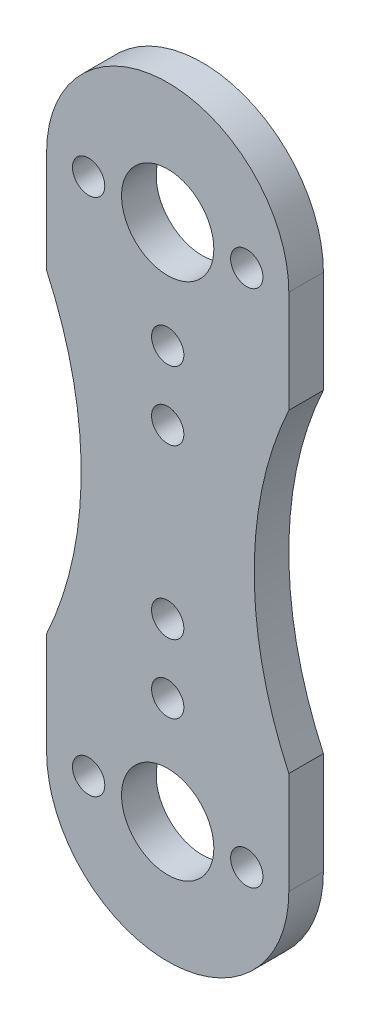
ISO-10303-21;
HEADER;
FILE_DESCRIPTION(('STEP AP214'),'2;1');
FILE_NAME('part.step','',(''),(''),'','','');
FILE_SCHEMA(('AUTOMOTIVE_DESIGN { 1 0 10303 214 1 1 1 1 }'));
ENDSEC;
DATA;
#1=APPLICATION_CONTEXT('core data for automotive mechanical design processes');
#2=APPLICATION_PROTOCOL_DEFINITION('international standard','automotive_design',2000,#1);
#3=PRODUCT_CONTEXT('',#1,'mechanical');
#4=PRODUCT('Part','Part','',(#3));
#5=PRODUCT_RELATED_PRODUCT_CATEGORY('part','',(#4));
#6=PRODUCT_DEFINITION_FORMATION('','',#4);
#7=PRODUCT_DEFINITION_CONTEXT('part definition',#1,'design');
#8=PRODUCT_DEFINITION('design','',#6,#7);
#9=PRODUCT_DEFINITION_SHAPE('','',#8);
#10=(LENGTH_UNIT() NAMED_UNIT(*) SI_UNIT(.MILLI.,.METRE.));
#11=(NAMED_UNIT(*) PLANE_ANGLE_UNIT() SI_UNIT($,.RADIAN.));
#12=(NAMED_UNIT(*) SI_UNIT($,.STERADIAN.) SOLID_ANGLE_UNIT());
#13=UNCERTAINTY_MEASURE_WITH_UNIT(LENGTH_MEASURE(1.E-05),#10,'distance_accuracy_value','');
#14=(GEOMETRIC_REPRESENTATION_CONTEXT(3) GLOBAL_UNCERTAINTY_ASSIGNED_CONTEXT((#13)) GLOBAL_UNIT_ASSIGNED_CONTEXT((#10,
#11,#12)) REPRESENTATION_CONTEXT('',''));
#15=CARTESIAN_POINT('',(0.,0.,0.));
#16=DIRECTION('',(0.,0.,1.));
#17=DIRECTION('',(1.,0.,0.));
#18=AXIS2_PLACEMENT_3D('',#15,#16,#17);
#19=CARTESIAN_POINT('',(-10.5,0.,3.));
#20=DIRECTION('',(1.,0.,0.));
#21=DIRECTION('',(0.,1.,0.));
#22=AXIS2_PLACEMENT_3D('',#19,#20,#21);
#23=PLANE('',#22);
#24=DIRECTION('',(0.,-1.,0.));
#25=VECTOR('',#24,1.);
#26=CARTESIAN_POINT('',(-10.5,0.,0.));
#27=LINE('',#26,#25);
#28=CARTESIAN_POINT('',(-10.5,22.5,0.));
#29=VERTEX_POINT('',#28);
#30=CARTESIAN_POINT('',(-10.5,13.6381816969859,0.));
#31=VERTEX_POINT('',#30);
#32=EDGE_CURVE('E183',#29,#31,#27,.T.);
#33=ORIENTED_EDGE('',*,*,#32,.T.);
#34=DIRECTION('',(0.,0.,-1.));
#35=VECTOR('',#34,1.);
#36=CARTESIAN_POINT('',(-10.5,13.6381816969859,3.));
#37=LINE('',#36,#35);
#38=CARTESIAN_POINT('',(-10.5,13.6381816969859,3.));
#39=VERTEX_POINT('',#38);
#40=EDGE_CURVE('E11',#39,#31,#37,.T.);
#41=ORIENTED_EDGE('',*,*,#40,.F.);
#42=DIRECTION('',(0.,-1.,0.));
#43=VECTOR('',#42,1.);
#44=CARTESIAN_POINT('',(-10.5,0.,3.));
#45=LINE('',#44,#43);
#46=CARTESIAN_POINT('',(-10.5,22.5,3.));
#47=VERTEX_POINT('',#46);
#48=EDGE_CURVE('E271',#47,#39,#45,.T.);
#49=ORIENTED_EDGE('',*,*,#48,.F.);
#50=DIRECTION('',(0.,0.,-1.));
#51=VECTOR('',#50,1.);
#52=CARTESIAN_POINT('',(-10.5,22.5,3.));
#53=LINE('',#52,#51);
#54=EDGE_CURVE('E166',#47,#29,#53,.T.);
#55=ORIENTED_EDGE('',*,*,#54,.T.);
#56=EDGE_LOOP('',(#33,#41,#49,#55));
#57=FACE_BOUND('',#56,.T.);
#58=ADVANCED_FACE('F41',(#57),#23,.F.);
#59=CARTESIAN_POINT('',(-40.,0.,3.));
#60=DIRECTION('',(0.,0.,-1.));
#61=DIRECTION('',(-1.,0.,0.));
#62=AXIS2_PLACEMENT_3D('',#59,#60,#61);
#63=CYLINDRICAL_SURFACE('',#62,32.5);
#64=CARTESIAN_POINT('',(-40.,0.,0.));
#65=DIRECTION('',(0.,0.,1.));
#66=DIRECTION('',(1.,0.,0.));
#67=AXIS2_PLACEMENT_3D('',#64,#65,#66);
#68=CIRCLE('',#67,32.5);
#69=CARTESIAN_POINT('',(-10.5,-13.6381816969859,0.));
#70=VERTEX_POINT('',#69);
#71=EDGE_CURVE('E187',#31,#70,#68,.F.);
#72=ORIENTED_EDGE('',*,*,#71,.T.);
#73=DIRECTION('',(0.,0.,-1.));
#74=VECTOR('',#73,1.);
#75=CARTESIAN_POINT('',(-10.5,-13.6381816969859,3.));
#76=LINE('',#75,#74);
#77=CARTESIAN_POINT('',(-10.5,-13.6381816969859,3.));
#78=VERTEX_POINT('',#77);
#79=EDGE_CURVE('E51',#78,#70,#76,.T.);
#80=ORIENTED_EDGE('',*,*,#79,.F.);
#81=CARTESIAN_POINT('',(-40.,0.,3.));
#82=DIRECTION('',(0.,0.,1.));
#83=DIRECTION('',(1.,0.,0.));
#84=AXIS2_PLACEMENT_3D('',#81,#82,#83);
#85=CIRCLE('',#84,32.5);
#86=EDGE_CURVE('E98',#39,#78,#85,.F.);
#87=ORIENTED_EDGE('',*,*,#86,.F.);
#88=ORIENTED_EDGE('',*,*,#40,.T.);
#89=EDGE_LOOP('',(#72,#80,#87,#88));
#90=FACE_BOUND('',#89,.T.);
#91=ADVANCED_FACE('F323',(#90),#63,.F.);
#92=CARTESIAN_POINT('',(-10.5,0.,3.));
#93=DIRECTION('',(1.,0.,0.));
#94=DIRECTION('',(0.,1.,0.));
#95=AXIS2_PLACEMENT_3D('',#92,#93,#94);
#96=PLANE('',#95);
#97=DIRECTION('',(0.,-1.,0.));
#98=VECTOR('',#97,1.);
#99=CARTESIAN_POINT('',(-10.5,0.,0.));
#100=LINE('',#99,#98);
#101=CARTESIAN_POINT('',(-10.5,-22.5,0.));
#102=VERTEX_POINT('',#101);
#103=EDGE_CURVE('E190',#70,#102,#100,.T.);
#104=ORIENTED_EDGE('',*,*,#103,.T.);
#105=DIRECTION('',(0.,0.,-1.));
#106=VECTOR('',#105,1.);
#107=CARTESIAN_POINT('',(-10.5,-22.5,3.));
#108=LINE('',#107,#106);
#109=CARTESIAN_POINT('',(-10.5,-22.5,3.));
#110=VERTEX_POINT('',#109);
#111=EDGE_CURVE('E243',#110,#102,#108,.T.);
#112=ORIENTED_EDGE('',*,*,#111,.F.);
#113=DIRECTION('',(0.,-1.,0.));
#114=VECTOR('',#113,1.);
#115=CARTESIAN_POINT('',(-10.5,0.,3.));
#116=LINE('',#115,#114);
#117=EDGE_CURVE('E252',#78,#110,#116,.T.);
#118=ORIENTED_EDGE('',*,*,#117,.F.);
#119=ORIENTED_EDGE('',*,*,#79,.T.);
#120=EDGE_LOOP('',(#104,#112,#118,#119));
#121=FACE_BOUND('',#120,.T.);
#122=ADVANCED_FACE('F250',(#121),#96,.F.);
#123=CARTESIAN_POINT('',(0.,-22.5,3.));
#124=DIRECTION('',(0.,0.,-1.));
#125=DIRECTION('',(-1.,0.,0.));
#126=AXIS2_PLACEMENT_3D('',#123,#124,#125);
#127=CYLINDRICAL_SURFACE('',#126,10.5);
#128=CARTESIAN_POINT('',(0.,-22.5,0.));
#129=DIRECTION('',(0.,0.,1.));
#130=DIRECTION('',(1.,0.,0.));
#131=AXIS2_PLACEMENT_3D('',#128,#129,#130);
#132=CIRCLE('',#131,10.5);
#133=CARTESIAN_POINT('',(10.5,-22.5,0.));
#134=VERTEX_POINT('',#133);
#135=EDGE_CURVE('E194',#134,#102,#132,.F.);
#136=ORIENTED_EDGE('',*,*,#135,.F.);
#137=DIRECTION('',(0.,0.,-1.));
#138=VECTOR('',#137,1.);
#139=CARTESIAN_POINT('',(10.5,-22.5,3.));
#140=LINE('',#139,#138);
#141=CARTESIAN_POINT('',(10.5,-22.5,3.));
#142=VERTEX_POINT('',#141);
#143=EDGE_CURVE('E240',#142,#134,#140,.T.);
#144=ORIENTED_EDGE('',*,*,#143,.F.);
#145=CARTESIAN_POINT('',(0.,-22.5,3.));
#146=DIRECTION('',(0.,0.,1.));
#147=DIRECTION('',(1.,0.,0.));
#148=AXIS2_PLACEMENT_3D('',#145,#146,#147);
#149=CIRCLE('',#148,10.5);
#150=EDGE_CURVE('E262',#142,#110,#149,.F.);
#151=ORIENTED_EDGE('',*,*,#150,.T.);
#152=ORIENTED_EDGE('',*,*,#111,.T.);
#153=EDGE_LOOP('',(#136,#144,#151,#152));
#154=FACE_BOUND('',#153,.T.);
#155=ADVANCED_FACE('F260',(#154),#127,.T.);
#156=CARTESIAN_POINT('',(10.5,0.,3.));
#157=DIRECTION('',(1.,0.,0.));
#158=DIRECTION('',(0.,1.,0.));
#159=AXIS2_PLACEMENT_3D('',#156,#157,#158);
#160=PLANE('',#159);
#161=DIRECTION('',(0.,-1.,0.));
#162=VECTOR('',#161,1.);
#163=CARTESIAN_POINT('',(10.5,0.,0.));
#164=LINE('',#163,#162);
#165=CARTESIAN_POINT('',(10.5,-13.6381816969859,0.));
#166=VERTEX_POINT('',#165);
#167=EDGE_CURVE('E198',#166,#134,#164,.T.);
#168=ORIENTED_EDGE('',*,*,#167,.F.);
#169=DIRECTION('',(0.,0.,-1.));
#170=VECTOR('',#169,1.);
#171=CARTESIAN_POINT('',(10.5,-13.6381816969859,3.));
#172=LINE('',#171,#170);
#173=CARTESIAN_POINT('',(10.5,-13.6381816969859,3.));
#174=VERTEX_POINT('',#173);
#175=EDGE_CURVE('E124',#174,#166,#172,.T.);
#176=ORIENTED_EDGE('',*,*,#175,.F.);
#177=DIRECTION('',(0.,-1.,0.));
#178=VECTOR('',#177,1.);
#179=CARTESIAN_POINT('',(10.5,0.,3.));
#180=LINE('',#179,#178);
#181=EDGE_CURVE('E132',#174,#142,#180,.T.);
#182=ORIENTED_EDGE('',*,*,#181,.T.);
#183=ORIENTED_EDGE('',*,*,#143,.T.);
#184=EDGE_LOOP('',(#168,#176,#182,#183));
#185=FACE_BOUND('',#184,.T.);
#186=ADVANCED_FACE('F334',(#185),#160,.T.);
#187=CARTESIAN_POINT('',(40.,0.,3.));
#188=DIRECTION('',(0.,0.,-1.));
#189=DIRECTION('',(-1.,0.,0.));
#190=AXIS2_PLACEMENT_3D('',#187,#188,#189);
#191=CYLINDRICAL_SURFACE('',#190,32.5);
#192=CARTESIAN_POINT('',(40.,0.,0.));
#193=DIRECTION('',(0.,0.,1.));
#194=DIRECTION('',(1.,0.,0.));
#195=AXIS2_PLACEMENT_3D('',#192,#193,#194);
#196=CIRCLE('',#195,32.5);
#197=CARTESIAN_POINT('',(10.5,13.6381816969859,0.));
#198=VERTEX_POINT('',#197);
#199=EDGE_CURVE('E118',#198,#166,#196,.T.);
#200=ORIENTED_EDGE('',*,*,#199,.F.);
#201=DIRECTION('',(0.,0.,-1.));
#202=VECTOR('',#201,1.);
#203=CARTESIAN_POINT('',(10.5,13.6381816969859,3.));
#204=LINE('',#203,#202);
#205=CARTESIAN_POINT('',(10.5,13.6381816969859,3.));
#206=VERTEX_POINT('',#205);
#207=EDGE_CURVE('E113',#206,#198,#204,.T.);
#208=ORIENTED_EDGE('',*,*,#207,.F.);
#209=CARTESIAN_POINT('',(40.,0.,3.));
#210=DIRECTION('',(0.,0.,1.));
#211=DIRECTION('',(1.,0.,0.));
#212=AXIS2_PLACEMENT_3D('',#209,#210,#211);
#213=CIRCLE('',#212,32.5);
#214=EDGE_CURVE('E116',#206,#174,#213,.T.);
#215=ORIENTED_EDGE('',*,*,#214,.T.);
#216=ORIENTED_EDGE('',*,*,#175,.T.);
#217=EDGE_LOOP('',(#200,#208,#215,#216));
#218=FACE_BOUND('',#217,.T.);
#219=ADVANCED_FACE('F115',(#218),#191,.F.);
#220=CARTESIAN_POINT('',(10.5,0.,3.));
#221=DIRECTION('',(1.,0.,0.));
#222=DIRECTION('',(0.,1.,0.));
#223=AXIS2_PLACEMENT_3D('',#220,#221,#222);
#224=PLANE('',#223);
#225=DIRECTION('',(0.,-1.,0.));
#226=VECTOR('',#225,1.);
#227=CARTESIAN_POINT('',(10.5,0.,0.));
#228=LINE('',#227,#226);
#229=CARTESIAN_POINT('',(10.5,22.5,0.));
#230=VERTEX_POINT('',#229);
#231=EDGE_CURVE('E204',#230,#198,#228,.T.);
#232=ORIENTED_EDGE('',*,*,#231,.F.);
#233=DIRECTION('',(0.,0.,-1.));
#234=VECTOR('',#233,1.);
#235=CARTESIAN_POINT('',(10.5,22.5,3.));
#236=LINE('',#235,#234);
#237=CARTESIAN_POINT('',(10.5,22.5,3.));
#238=VERTEX_POINT('',#237);
#239=EDGE_CURVE('E87',#238,#230,#236,.T.);
#240=ORIENTED_EDGE('',*,*,#239,.F.);
#241=DIRECTION('',(0.,-1.,0.));
#242=VECTOR('',#241,1.);
#243=CARTESIAN_POINT('',(10.5,0.,3.));
#244=LINE('',#243,#242);
#245=EDGE_CURVE('E129',#238,#206,#244,.T.);
#246=ORIENTED_EDGE('',*,*,#245,.T.);
#247=ORIENTED_EDGE('',*,*,#207,.T.);
#248=EDGE_LOOP('',(#232,#240,#246,#247));
#249=FACE_BOUND('',#248,.T.);
#250=ADVANCED_FACE('F135',(#249),#224,.T.);
#251=CARTESIAN_POINT('',(0.,7.28,3.));
#252=DIRECTION('',(0.,0.,-1.));
#253=DIRECTION('',(-1.,0.,0.));
#254=AXIS2_PLACEMENT_3D('',#251,#252,#253);
#255=CYLINDRICAL_SURFACE('',#254,1.4);
#256=CARTESIAN_POINT('',(0.,7.28,3.));
#257=DIRECTION('',(0.,0.,1.));
#258=DIRECTION('',(1.,0.,0.));
#259=AXIS2_PLACEMENT_3D('',#256,#257,#258);
#260=CIRCLE('',#259,1.4);
#261=CARTESIAN_POINT('',(1.4,7.28,3.));
#262=VERTEX_POINT('',#261);
#263=EDGE_CURVE('E158',#262,#262,#260,.T.);
#264=ORIENTED_EDGE('',*,*,#263,.T.);
#265=EDGE_LOOP('',(#264));
#266=FACE_BOUND('',#265,.T.);
#267=CARTESIAN_POINT('',(0.,7.28,0.));
#268=DIRECTION('',(0.,0.,1.));
#269=DIRECTION('',(1.,0.,0.));
#270=AXIS2_PLACEMENT_3D('',#267,#268,#269);
#271=CIRCLE('',#270,1.4);
#272=CARTESIAN_POINT('',(1.4,7.28,0.));
#273=VERTEX_POINT('',#272);
#274=EDGE_CURVE('E225',#273,#273,#271,.T.);
#275=ORIENTED_EDGE('',*,*,#274,.F.);
#276=EDGE_LOOP('',(#275));
#277=FACE_BOUND('',#276,.T.);
#278=ADVANCED_FACE('F341',(#266,#277),#255,.F.);
#279=CARTESIAN_POINT('',(-6.855,-22.5,3.));
#280=DIRECTION('',(0.,0.,-1.));
#281=DIRECTION('',(-1.,0.,0.));
#282=AXIS2_PLACEMENT_3D('',#279,#280,#281);
#283=CYLINDRICAL_SURFACE('',#282,1.4);
#284=CARTESIAN_POINT('',(-6.855,-22.5,3.));
#285=DIRECTION('',(0.,0.,1.));
#286=DIRECTION('',(1.,0.,0.));
#287=AXIS2_PLACEMENT_3D('',#284,#285,#286);
#288=CIRCLE('',#287,1.4);
#289=CARTESIAN_POINT('',(-5.455,-22.5,3.));
#290=VERTEX_POINT('',#289);
#291=EDGE_CURVE('E154',#290,#290,#288,.T.);
#292=ORIENTED_EDGE('',*,*,#291,.T.);
#293=EDGE_LOOP('',(#292));
#294=FACE_BOUND('',#293,.T.);
#295=CARTESIAN_POINT('',(-6.855,-22.5,0.));
#296=DIRECTION('',(0.,0.,1.));
#297=DIRECTION('',(1.,0.,0.));
#298=AXIS2_PLACEMENT_3D('',#295,#296,#297);
#299=CIRCLE('',#298,1.4);
#300=CARTESIAN_POINT('',(-5.455,-22.5,0.));
#301=VERTEX_POINT('',#300);
#302=EDGE_CURVE('E221',#301,#301,#299,.T.);
#303=ORIENTED_EDGE('',*,*,#302,.F.);
#304=EDGE_LOOP('',(#303));
#305=FACE_BOUND('',#304,.T.);
#306=ADVANCED_FACE('F353',(#294,#305),#283,.F.);
#307=CARTESIAN_POINT('',(0.,-7.28,3.));
#308=DIRECTION('',(0.,0.,-1.));
#309=DIRECTION('',(-1.,0.,0.));
#310=AXIS2_PLACEMENT_3D('',#307,#308,#309);
#311=CYLINDRICAL_SURFACE('',#310,1.4);
#312=CARTESIAN_POINT('',(0.,-7.28,3.));
#313=DIRECTION('',(0.,0.,1.));
#314=DIRECTION('',(1.,0.,0.));
#315=AXIS2_PLACEMENT_3D('',#312,#313,#314);
#316=CIRCLE('',#315,1.4);
#317=CARTESIAN_POINT('',(1.4,-7.28,3.));
#318=VERTEX_POINT('',#317);
#319=EDGE_CURVE('E150',#318,#318,#316,.F.);
#320=ORIENTED_EDGE('',*,*,#319,.F.);
#321=EDGE_LOOP('',(#320));
#322=FACE_BOUND('',#321,.T.);
#323=CARTESIAN_POINT('',(0.,-7.28,0.));
#324=DIRECTION('',(0.,0.,1.));
#325=DIRECTION('',(1.,0.,0.));
#326=AXIS2_PLACEMENT_3D('',#323,#324,#325);
#327=CIRCLE('',#326,1.4);
#328=CARTESIAN_POINT('',(1.4,-7.28,0.));
#329=VERTEX_POINT('',#328);
#330=EDGE_CURVE('E217',#329,#329,#327,.F.);
#331=ORIENTED_EDGE('',*,*,#330,.T.);
#332=EDGE_LOOP('',(#331));
#333=FACE_BOUND('',#332,.T.);
#334=ADVANCED_FACE('F349',(#322,#333),#311,.F.);
#335=CARTESIAN_POINT('',(0.,-22.5,3.));
#336=DIRECTION('',(0.,0.,-1.));
#337=DIRECTION('',(-1.,0.,0.));
#338=AXIS2_PLACEMENT_3D('',#335,#336,#337);
#339=CYLINDRICAL_SURFACE('',#338,4.00000000000003);
#340=CARTESIAN_POINT('',(0.,-22.5,3.));
#341=DIRECTION('',(0.,0.,1.));
#342=DIRECTION('',(1.,0.,0.));
#343=AXIS2_PLACEMENT_3D('',#340,#341,#342);
#344=CIRCLE('',#343,4.00000000000003);
#345=CARTESIAN_POINT('',(4.00000000000003,-22.5,3.));
#346=VERTEX_POINT('',#345);
#347=EDGE_CURVE('E146',#346,#346,#344,.F.);
#348=ORIENTED_EDGE('',*,*,#347,.F.);
#349=EDGE_LOOP('',(#348));
#350=FACE_BOUND('',#349,.T.);
#351=CARTESIAN_POINT('',(0.,-22.5,0.));
#352=DIRECTION('',(0.,0.,1.));
#353=DIRECTION('',(1.,0.,0.));
#354=AXIS2_PLACEMENT_3D('',#351,#352,#353);
#355=CIRCLE('',#354,4.00000000000003);
#356=CARTESIAN_POINT('',(4.00000000000003,-22.5,0.));
#357=VERTEX_POINT('',#356);
#358=EDGE_CURVE('E213',#357,#357,#355,.F.);
#359=ORIENTED_EDGE('',*,*,#358,.T.);
#360=EDGE_LOOP('',(#359));
#361=FACE_BOUND('',#360,.T.);
#362=ADVANCED_FACE('F345',(#350,#361),#339,.F.);
#363=CARTESIAN_POINT('',(0.,22.5,3.));
#364=DIRECTION('',(0.,0.,-1.));
#365=DIRECTION('',(-1.,0.,0.));
#366=AXIS2_PLACEMENT_3D('',#363,#364,#365);
#367=CYLINDRICAL_SURFACE('',#366,4.00000000000002);
#368=CARTESIAN_POINT('',(0.,22.5,3.));
#369=DIRECTION('',(0.,0.,1.));
#370=DIRECTION('',(1.,0.,0.));
#371=AXIS2_PLACEMENT_3D('',#368,#369,#370);
#372=CIRCLE('',#371,4.00000000000002);
#373=CARTESIAN_POINT('',(4.00000000000002,22.5,3.));
#374=VERTEX_POINT('',#373);
#375=EDGE_CURVE('E139',#374,#374,#372,.T.);
#376=ORIENTED_EDGE('',*,*,#375,.T.);
#377=EDGE_LOOP('',(#376));
#378=FACE_BOUND('',#377,.T.);
#379=CARTESIAN_POINT('',(0.,22.5,0.));
#380=DIRECTION('',(0.,0.,1.));
#381=DIRECTION('',(1.,0.,0.));
#382=AXIS2_PLACEMENT_3D('',#379,#380,#381);
#383=CIRCLE('',#382,4.00000000000002);
#384=CARTESIAN_POINT('',(4.00000000000002,22.5,0.));
#385=VERTEX_POINT('',#384);
#386=EDGE_CURVE('E209',#385,#385,#383,.T.);
#387=ORIENTED_EDGE('',*,*,#386,.F.);
#388=EDGE_LOOP('',(#387));
#389=FACE_BOUND('',#388,.T.);
#390=ADVANCED_FACE('F319',(#378,#389),#367,.F.);
#391=CARTESIAN_POINT('',(0.,22.5,3.));
#392=DIRECTION('',(0.,0.,-1.));
#393=DIRECTION('',(-1.,0.,0.));
#394=AXIS2_PLACEMENT_3D('',#391,#392,#393);
#395=CYLINDRICAL_SURFACE('',#394,10.5);
#396=CARTESIAN_POINT('',(0.,22.5,0.));
#397=DIRECTION('',(0.,0.,1.));
#398=DIRECTION('',(1.,0.,0.));
#399=AXIS2_PLACEMENT_3D('',#396,#397,#398);
#400=CIRCLE('',#399,10.5);
#401=EDGE_CURVE('E90',#230,#29,#400,.T.);
#402=ORIENTED_EDGE('',*,*,#401,.T.);
#403=ORIENTED_EDGE('',*,*,#54,.F.);
#404=CARTESIAN_POINT('',(0.,22.5,3.));
#405=DIRECTION('',(0.,0.,1.));
#406=DIRECTION('',(1.,0.,0.));
#407=AXIS2_PLACEMENT_3D('',#404,#405,#406);
#408=CIRCLE('',#407,10.5);
#409=EDGE_CURVE('E59',#238,#47,#408,.T.);
#410=ORIENTED_EDGE('',*,*,#409,.F.);
#411=ORIENTED_EDGE('',*,*,#239,.T.);
#412=EDGE_LOOP('',(#402,#403,#410,#411));
#413=FACE_BOUND('',#412,.T.);
#414=ADVANCED_FACE('F310',(#413),#395,.T.);
#415=CARTESIAN_POINT('',(0.,13.23,3.));
#416=DIRECTION('',(0.,0.,-1.));
#417=DIRECTION('',(-1.,0.,0.));
#418=AXIS2_PLACEMENT_3D('',#415,#416,#417);
#419=CYLINDRICAL_SURFACE('',#418,1.4);
#420=CARTESIAN_POINT('',(0.,13.23,3.));
#421=DIRECTION('',(0.,0.,1.));
#422=DIRECTION('',(1.,0.,0.));
#423=AXIS2_PLACEMENT_3D('',#420,#421,#422);
#424=CIRCLE('',#423,1.4);
#425=CARTESIAN_POINT('',(1.4,13.23,3.));
#426=VERTEX_POINT('',#425);
#427=EDGE_CURVE('E274',#426,#426,#424,.T.);
#428=ORIENTED_EDGE('',*,*,#427,.T.);
#429=EDGE_LOOP('',(#428));
#430=FACE_BOUND('',#429,.T.);
#431=CARTESIAN_POINT('',(0.,13.23,0.));
#432=DIRECTION('',(0.,0.,1.));
#433=DIRECTION('',(1.,0.,0.));
#434=AXIS2_PLACEMENT_3D('',#431,#432,#433);
#435=CIRCLE('',#434,1.4);
#436=CARTESIAN_POINT('',(1.4,13.23,0.));
#437=VERTEX_POINT('',#436);
#438=EDGE_CURVE('E179',#437,#437,#435,.T.);
#439=ORIENTED_EDGE('',*,*,#438,.F.);
#440=EDGE_LOOP('',(#439));
#441=FACE_BOUND('',#440,.T.);
#442=ADVANCED_FACE('F307',(#430,#441),#419,.F.);
#443=CARTESIAN_POINT('',(6.855,22.5,3.));
#444=DIRECTION('',(0.,0.,-1.));
#445=DIRECTION('',(-1.,0.,0.));
#446=AXIS2_PLACEMENT_3D('',#443,#444,#445);
#447=CYLINDRICAL_SURFACE('',#446,1.4);
#448=CARTESIAN_POINT('',(6.855,22.5,3.));
#449=DIRECTION('',(0.,0.,1.));
#450=DIRECTION('',(1.,0.,0.));
#451=AXIS2_PLACEMENT_3D('',#448,#449,#450);
#452=CIRCLE('',#451,1.4);
#453=CARTESIAN_POINT('',(8.255,22.5,3.));
#454=VERTEX_POINT('',#453);
#455=EDGE_CURVE('E278',#454,#454,#452,.T.);
#456=ORIENTED_EDGE('',*,*,#455,.T.);
#457=EDGE_LOOP('',(#456));
#458=FACE_BOUND('',#457,.T.);
#459=CARTESIAN_POINT('',(6.855,22.5,0.));
#460=DIRECTION('',(0.,0.,1.));
#461=DIRECTION('',(1.,0.,0.));
#462=AXIS2_PLACEMENT_3D('',#459,#460,#461);
#463=CIRCLE('',#462,1.4);
#464=CARTESIAN_POINT('',(8.255,22.5,0.));
#465=VERTEX_POINT('',#464);
#466=EDGE_CURVE('E175',#465,#465,#463,.T.);
#467=ORIENTED_EDGE('',*,*,#466,.F.);
#468=EDGE_LOOP('',(#467));
#469=FACE_BOUND('',#468,.T.);
#470=ADVANCED_FACE('F309',(#458,#469),#447,.F.);
#471=CARTESIAN_POINT('',(-6.855,22.5,3.));
#472=DIRECTION('',(0.,0.,-1.));
#473=DIRECTION('',(-1.,0.,0.));
#474=AXIS2_PLACEMENT_3D('',#471,#472,#473);
#475=CYLINDRICAL_SURFACE('',#474,1.4);
#476=CARTESIAN_POINT('',(-6.855,22.5,3.));
#477=DIRECTION('',(0.,0.,1.));
#478=DIRECTION('',(1.,0.,0.));
#479=AXIS2_PLACEMENT_3D('',#476,#477,#478);
#480=CIRCLE('',#479,1.4);
#481=CARTESIAN_POINT('',(-5.455,22.5,3.));
#482=VERTEX_POINT('',#481);
#483=EDGE_CURVE('E282',#482,#482,#480,.F.);
#484=ORIENTED_EDGE('',*,*,#483,.F.);
#485=EDGE_LOOP('',(#484));
#486=FACE_BOUND('',#485,.T.);
#487=CARTESIAN_POINT('',(-6.855,22.5,0.));
#488=DIRECTION('',(0.,0.,1.));
#489=DIRECTION('',(1.,0.,0.));
#490=AXIS2_PLACEMENT_3D('',#487,#488,#489);
#491=CIRCLE('',#490,1.4);
#492=CARTESIAN_POINT('',(-5.455,22.5,0.));
#493=VERTEX_POINT('',#492);
#494=EDGE_CURVE('E171',#493,#493,#491,.F.);
#495=ORIENTED_EDGE('',*,*,#494,.T.);
#496=EDGE_LOOP('',(#495));
#497=FACE_BOUND('',#496,.T.);
#498=ADVANCED_FACE('F295',(#486,#497),#475,.F.);
#499=CARTESIAN_POINT('',(0.,-13.23,3.));
#500=DIRECTION('',(0.,0.,-1.));
#501=DIRECTION('',(-1.,0.,0.));
#502=AXIS2_PLACEMENT_3D('',#499,#500,#501);
#503=CYLINDRICAL_SURFACE('',#502,1.4);
#504=CARTESIAN_POINT('',(0.,-13.23,3.));
#505=DIRECTION('',(0.,0.,1.));
#506=DIRECTION('',(1.,0.,0.));
#507=AXIS2_PLACEMENT_3D('',#504,#505,#506);
#508=CIRCLE('',#507,1.4);
#509=CARTESIAN_POINT('',(1.4,-13.23,3.));
#510=VERTEX_POINT('',#509);
#511=EDGE_CURVE('E233',#510,#510,#508,.F.);
#512=ORIENTED_EDGE('',*,*,#511,.F.);
#513=EDGE_LOOP('',(#512));
#514=FACE_BOUND('',#513,.T.);
#515=CARTESIAN_POINT('',(0.,-13.23,0.));
#516=DIRECTION('',(0.,0.,1.));
#517=DIRECTION('',(1.,0.,0.));
#518=AXIS2_PLACEMENT_3D('',#515,#516,#517);
#519=CIRCLE('',#518,1.4);
#520=CARTESIAN_POINT('',(1.4,-13.23,0.));
#521=VERTEX_POINT('',#520);
#522=EDGE_CURVE('E167',#521,#521,#519,.F.);
#523=ORIENTED_EDGE('',*,*,#522,.T.);
#524=EDGE_LOOP('',(#523));
#525=FACE_BOUND('',#524,.T.);
#526=ADVANCED_FACE('F43',(#514,#525),#503,.F.);
#527=CARTESIAN_POINT('',(6.855,-22.5,3.));
#528=DIRECTION('',(0.,0.,-1.));
#529=DIRECTION('',(-1.,0.,0.));
#530=AXIS2_PLACEMENT_3D('',#527,#528,#529);
#531=CYLINDRICAL_SURFACE('',#530,1.4);
#532=CARTESIAN_POINT('',(6.855,-22.5,3.));
#533=DIRECTION('',(0.,0.,1.));
#534=DIRECTION('',(1.,0.,0.));
#535=AXIS2_PLACEMENT_3D('',#532,#533,#534);
#536=CIRCLE('',#535,1.4);
#537=CARTESIAN_POINT('',(8.255,-22.5,3.));
#538=VERTEX_POINT('',#537);
#539=EDGE_CURVE('E162',#538,#538,#536,.F.);
#540=ORIENTED_EDGE('',*,*,#539,.F.);
#541=EDGE_LOOP('',(#540));
#542=FACE_BOUND('',#541,.T.);
#543=CARTESIAN_POINT('',(6.855,-22.5,0.));
#544=DIRECTION('',(0.,0.,1.));
#545=DIRECTION('',(1.,0.,0.));
#546=AXIS2_PLACEMENT_3D('',#543,#544,#545);
#547=CIRCLE('',#546,1.4);
#548=CARTESIAN_POINT('',(8.255,-22.5,0.));
#549=VERTEX_POINT('',#548);
#550=EDGE_CURVE('E229',#549,#549,#547,.F.);
#551=ORIENTED_EDGE('',*,*,#550,.T.);
#552=EDGE_LOOP('',(#551));
#553=FACE_BOUND('',#552,.T.);
#554=ADVANCED_FACE('F294',(#542,#553),#531,.F.);
#555=CARTESIAN_POINT('',(0.,0.,3.));
#556=DIRECTION('',(0.,0.,1.));
#557=DIRECTION('',(1.,0.,0.));
#558=AXIS2_PLACEMENT_3D('',#555,#556,#557);
#559=PLANE('',#558);
#560=ORIENTED_EDGE('',*,*,#511,.T.);
#561=EDGE_LOOP('',(#560));
#562=FACE_BOUND('',#561,.T.);
#563=ORIENTED_EDGE('',*,*,#483,.T.);
#564=EDGE_LOOP('',(#563));
#565=FACE_BOUND('',#564,.T.);
#566=ORIENTED_EDGE('',*,*,#455,.F.);
#567=EDGE_LOOP('',(#566));
#568=FACE_BOUND('',#567,.T.);
#569=ORIENTED_EDGE('',*,*,#427,.F.);
#570=EDGE_LOOP('',(#569));
#571=FACE_BOUND('',#570,.T.);
#572=ORIENTED_EDGE('',*,*,#48,.T.);
#573=ORIENTED_EDGE('',*,*,#86,.T.);
#574=ORIENTED_EDGE('',*,*,#117,.T.);
#575=ORIENTED_EDGE('',*,*,#150,.F.);
#576=ORIENTED_EDGE('',*,*,#181,.F.);
#577=ORIENTED_EDGE('',*,*,#214,.F.);
#578=ORIENTED_EDGE('',*,*,#245,.F.);
#579=ORIENTED_EDGE('',*,*,#409,.T.);
#580=EDGE_LOOP('',(#572,#573,#574,#575,#576,#577,#578,#579));
#581=FACE_BOUND('',#580,.T.);
#582=ORIENTED_EDGE('',*,*,#375,.F.);
#583=EDGE_LOOP('',(#582));
#584=FACE_BOUND('',#583,.T.);
#585=ORIENTED_EDGE('',*,*,#347,.T.);
#586=EDGE_LOOP('',(#585));
#587=FACE_BOUND('',#586,.T.);
#588=ORIENTED_EDGE('',*,*,#319,.T.);
#589=EDGE_LOOP('',(#588));
#590=FACE_BOUND('',#589,.T.);
#591=ORIENTED_EDGE('',*,*,#291,.F.);
#592=EDGE_LOOP('',(#591));
#593=FACE_BOUND('',#592,.T.);
#594=ORIENTED_EDGE('',*,*,#263,.F.);
#595=EDGE_LOOP('',(#594));
#596=FACE_BOUND('',#595,.T.);
#597=ORIENTED_EDGE('',*,*,#539,.T.);
#598=EDGE_LOOP('',(#597));
#599=FACE_BOUND('',#598,.T.);
#600=ADVANCED_FACE('F127',(#562,#565,#568,#571,#581,#584,#587,#590,#593,#596,#599),#559,.T.);
#601=CARTESIAN_POINT('',(0.,0.,0.));
#602=DIRECTION('',(0.,0.,1.));
#603=DIRECTION('',(1.,0.,0.));
#604=AXIS2_PLACEMENT_3D('',#601,#602,#603);
#605=PLANE('',#604);
#606=ORIENTED_EDGE('',*,*,#522,.F.);
#607=EDGE_LOOP('',(#606));
#608=FACE_BOUND('',#607,.T.);
#609=ORIENTED_EDGE('',*,*,#494,.F.);
#610=EDGE_LOOP('',(#609));
#611=FACE_BOUND('',#610,.T.);
#612=ORIENTED_EDGE('',*,*,#466,.T.);
#613=EDGE_LOOP('',(#612));
#614=FACE_BOUND('',#613,.T.);
#615=ORIENTED_EDGE('',*,*,#438,.T.);
#616=EDGE_LOOP('',(#615));
#617=FACE_BOUND('',#616,.T.);
#618=ORIENTED_EDGE('',*,*,#32,.F.);
#619=ORIENTED_EDGE('',*,*,#401,.F.);
#620=ORIENTED_EDGE('',*,*,#231,.T.);
#621=ORIENTED_EDGE('',*,*,#199,.T.);
#622=ORIENTED_EDGE('',*,*,#167,.T.);
#623=ORIENTED_EDGE('',*,*,#135,.T.);
#624=ORIENTED_EDGE('',*,*,#103,.F.);
#625=ORIENTED_EDGE('',*,*,#71,.F.);
#626=EDGE_LOOP('',(#618,#619,#620,#621,#622,#623,#624,#625));
#627=FACE_BOUND('',#626,.T.);
#628=ORIENTED_EDGE('',*,*,#386,.T.);
#629=EDGE_LOOP('',(#628));
#630=FACE_BOUND('',#629,.T.);
#631=ORIENTED_EDGE('',*,*,#358,.F.);
#632=EDGE_LOOP('',(#631));
#633=FACE_BOUND('',#632,.T.);
#634=ORIENTED_EDGE('',*,*,#330,.F.);
#635=EDGE_LOOP('',(#634));
#636=FACE_BOUND('',#635,.T.);
#637=ORIENTED_EDGE('',*,*,#302,.T.);
#638=EDGE_LOOP('',(#637));
#639=FACE_BOUND('',#638,.T.);
#640=ORIENTED_EDGE('',*,*,#274,.T.);
#641=EDGE_LOOP('',(#640));
#642=FACE_BOUND('',#641,.T.);
#643=ORIENTED_EDGE('',*,*,#550,.F.);
#644=EDGE_LOOP('',(#643));
#645=FACE_BOUND('',#644,.T.);
#646=ADVANCED_FACE('F255',(#608,#611,#614,#617,#627,#630,#633,#636,#639,#642,#645),#605,.F.);
#647=CLOSED_SHELL('',(#58,#91,#122,#155,#186,#219,#250,#278,#306,#334,#362,#390,#414,#442,#470,
#498,#526,#554,#600,#646));
#648=MANIFOLD_SOLID_BREP('B2',#647);
#649=ADVANCED_BREP_SHAPE_REPRESENTATION('',(#18,#648),#14);
#650=SHAPE_DEFINITION_REPRESENTATION(#9,#649);
ENDSEC;
END-ISO-10303-21;
